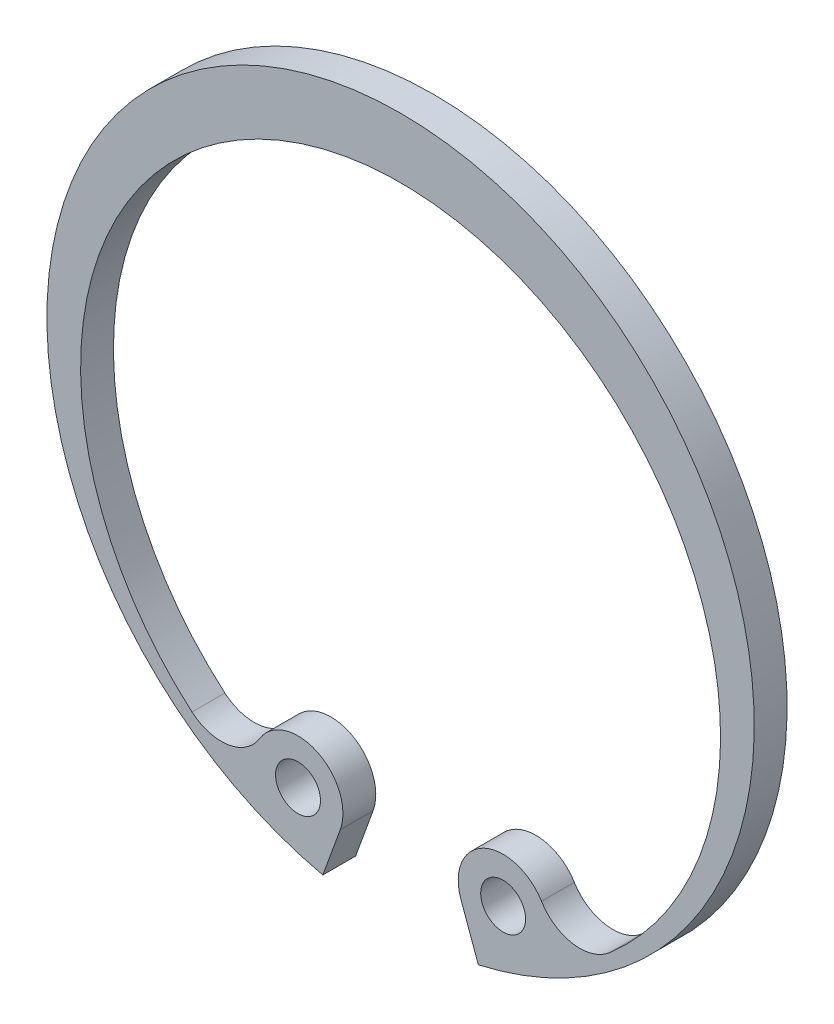
ISO-10303-21;
HEADER;
FILE_DESCRIPTION(('STEP AP214'),'2;1');
FILE_NAME('part.step','',(''),(''),'','','');
FILE_SCHEMA(('AUTOMOTIVE_DESIGN { 1 0 10303 214 1 1 1 1 }'));
ENDSEC;
DATA;
#1=APPLICATION_CONTEXT('core data for automotive mechanical design processes');
#2=APPLICATION_PROTOCOL_DEFINITION('international standard','automotive_design',2000,#1);
#3=PRODUCT_CONTEXT('',#1,'mechanical');
#4=PRODUCT('Part','Part','',(#3));
#5=PRODUCT_RELATED_PRODUCT_CATEGORY('part','',(#4));
#6=PRODUCT_DEFINITION_FORMATION('','',#4);
#7=PRODUCT_DEFINITION_CONTEXT('part definition',#1,'design');
#8=PRODUCT_DEFINITION('design','',#6,#7);
#9=PRODUCT_DEFINITION_SHAPE('','',#8);
#10=(LENGTH_UNIT() NAMED_UNIT(*) SI_UNIT(.MILLI.,.METRE.));
#11=(NAMED_UNIT(*) PLANE_ANGLE_UNIT() SI_UNIT($,.RADIAN.));
#12=(NAMED_UNIT(*) SI_UNIT($,.STERADIAN.) SOLID_ANGLE_UNIT());
#13=UNCERTAINTY_MEASURE_WITH_UNIT(LENGTH_MEASURE(1.E-05),#10,'distance_accuracy_value','');
#14=(GEOMETRIC_REPRESENTATION_CONTEXT(3) GLOBAL_UNCERTAINTY_ASSIGNED_CONTEXT((#13)) GLOBAL_UNIT_ASSIGNED_CONTEXT((#10,
#11,#12)) REPRESENTATION_CONTEXT('',''));
#15=CARTESIAN_POINT('',(0.,0.,0.));
#16=DIRECTION('',(0.,0.,1.));
#17=DIRECTION('',(1.,0.,0.));
#18=AXIS2_PLACEMENT_3D('',#15,#16,#17);
#19=CARTESIAN_POINT('',(0.,0.,0.975));
#20=DIRECTION('',(0.,0.,-1.));
#21=DIRECTION('',(-1.,0.,0.));
#22=AXIS2_PLACEMENT_3D('',#19,#20,#21);
#23=PLANE('',#22);
#24=CARTESIAN_POINT('',(-5.32360078088962,-6.98043795968956,0.975));
#25=DIRECTION('',(0.,0.,-1.));
#26=DIRECTION('',(-1.,0.,0.));
#27=AXIS2_PLACEMENT_3D('',#24,#25,#26);
#28=CIRCLE('',#27,1.33333333333333);
#29=CARTESIAN_POINT('',(-6.19276009205528,-7.99154619800622,0.975));
#30=VERTEX_POINT('',#29);
#31=CARTESIAN_POINT('',(-4.18415582842588,-7.67285617008171,0.975));
#32=VERTEX_POINT('',#31);
#33=EDGE_CURVE('E141',#30,#32,#28,.F.);
#34=ORIENTED_EDGE('',*,*,#33,.T.);
#35=CARTESIAN_POINT('',(-3.04471087596214,-8.36527438047387,0.975));
#36=DIRECTION('',(0.,0.,-1.));
#37=DIRECTION('',(-1.,0.,0.));
#38=AXIS2_PLACEMENT_3D('',#35,#36,#37);
#39=CIRCLE('',#38,1.33333333333333);
#40=CARTESIAN_POINT('',(-1.79178738158093,-8.82130123824143,0.975));
#41=VERTEX_POINT('',#40);
#42=EDGE_CURVE('E97',#41,#32,#39,.F.);
#43=ORIENTED_EDGE('',*,*,#42,.F.);
#44=DIRECTION('',(-0.34202014332567,-0.939692620785908,0.));
#45=VECTOR('',#44,1.);
#46=CARTESIAN_POINT('',(-1.79178738158093,-8.82130123824143,0.975));
#47=LINE('',#46,#45);
#48=CARTESIAN_POINT('',(-2.30921625274565,-10.2429253779404,0.975));
#49=VERTEX_POINT('',#48);
#50=EDGE_CURVE('E94',#41,#49,#47,.T.);
#51=ORIENTED_EDGE('',*,*,#50,.T.);
#52=CARTESIAN_POINT('',(0.,0.,0.975));
#53=DIRECTION('',(0.,0.,-1.));
#54=DIRECTION('',(-1.,0.,0.));
#55=AXIS2_PLACEMENT_3D('',#52,#53,#54);
#56=CIRCLE('',#55,10.5);
#57=CARTESIAN_POINT('',(2.30921625274565,-10.2429253779404,0.975));
#58=VERTEX_POINT('',#57);
#59=EDGE_CURVE('E82',#58,#49,#56,.F.);
#60=ORIENTED_EDGE('',*,*,#59,.F.);
#61=DIRECTION('',(-0.34202014332567,0.939692620785908,0.));
#62=VECTOR('',#61,1.);
#63=CARTESIAN_POINT('',(1.79178738158093,-8.82130123824143,0.975));
#64=LINE('',#63,#62);
#65=CARTESIAN_POINT('',(1.79178738158093,-8.82130123824143,0.975));
#66=VERTEX_POINT('',#65);
#67=EDGE_CURVE('E109',#58,#66,#64,.T.);
#68=ORIENTED_EDGE('',*,*,#67,.T.);
#69=CARTESIAN_POINT('',(3.04471087596214,-8.36527438047387,0.975));
#70=DIRECTION('',(0.,0.,-1.));
#71=DIRECTION('',(-1.,0.,0.));
#72=AXIS2_PLACEMENT_3D('',#69,#70,#71);
#73=CIRCLE('',#72,1.33333333333333);
#74=CARTESIAN_POINT('',(4.18415582842588,-7.67285617008171,0.975));
#75=VERTEX_POINT('',#74);
#76=EDGE_CURVE('E130',#75,#66,#73,.F.);
#77=ORIENTED_EDGE('',*,*,#76,.F.);
#78=CARTESIAN_POINT('',(5.32360078088962,-6.98043795968956,0.975));
#79=DIRECTION('',(0.,0.,-1.));
#80=DIRECTION('',(-1.,0.,0.));
#81=AXIS2_PLACEMENT_3D('',#78,#79,#80);
#82=CIRCLE('',#81,1.33333333333333);
#83=CARTESIAN_POINT('',(6.19276009205528,-7.99154619800622,0.975));
#84=VERTEX_POINT('',#83);
#85=EDGE_CURVE('E134',#75,#84,#82,.F.);
#86=ORIENTED_EDGE('',*,*,#85,.T.);
#87=CARTESIAN_POINT('',(0.,-0.7874,0.975));
#88=DIRECTION('',(0.,0.,-1.));
#89=DIRECTION('',(-1.,0.,0.));
#90=AXIS2_PLACEMENT_3D('',#87,#88,#89);
#91=CIRCLE('',#90,9.5);
#92=EDGE_CURVE('E138',#84,#30,#91,.F.);
#93=ORIENTED_EDGE('',*,*,#92,.T.);
#94=EDGE_LOOP('',(#34,#43,#51,#60,#68,#77,#86,#93));
#95=FACE_BOUND('',#94,.T.);
#96=CARTESIAN_POINT('',(3.04471087596214,-8.36527438047387,0.975));
#97=DIRECTION('',(0.,0.,-1.));
#98=DIRECTION('',(-1.,0.,0.));
#99=AXIS2_PLACEMENT_3D('',#96,#97,#98);
#100=CIRCLE('',#99,0.666666666666667);
#101=CARTESIAN_POINT('',(2.37804420929547,-8.36527438047387,0.975));
#102=VERTEX_POINT('',#101);
#103=EDGE_CURVE('E21',#102,#102,#100,.F.);
#104=ORIENTED_EDGE('',*,*,#103,.T.);
#105=EDGE_LOOP('',(#104));
#106=FACE_BOUND('',#105,.T.);
#107=CARTESIAN_POINT('',(-3.04471087596214,-8.36527438047387,0.975));
#108=DIRECTION('',(0.,0.,-1.));
#109=DIRECTION('',(-1.,0.,0.));
#110=AXIS2_PLACEMENT_3D('',#107,#108,#109);
#111=CIRCLE('',#110,0.666666666666667);
#112=CARTESIAN_POINT('',(-3.71137754262881,-8.36527438047387,0.975));
#113=VERTEX_POINT('',#112);
#114=EDGE_CURVE('E110',#113,#113,#111,.F.);
#115=ORIENTED_EDGE('',*,*,#114,.T.);
#116=EDGE_LOOP('',(#115));
#117=FACE_BOUND('',#116,.T.);
#118=ADVANCED_FACE('F18',(#95,#106,#117),#23,.T.);
#119=CARTESIAN_POINT('',(3.04471087596214,-8.36527438047387,1.95));
#120=DIRECTION('',(0.,0.,-1.));
#121=DIRECTION('',(-1.,0.,0.));
#122=AXIS2_PLACEMENT_3D('',#119,#120,#121);
#123=CYLINDRICAL_SURFACE('',#122,0.666666666666667);
#124=CARTESIAN_POINT('',(3.04471087596214,-8.36527438047387,1.95));
#125=DIRECTION('',(0.,0.,-1.));
#126=DIRECTION('',(-1.,0.,0.));
#127=AXIS2_PLACEMENT_3D('',#124,#125,#126);
#128=CIRCLE('',#127,0.666666666666667);
#129=CARTESIAN_POINT('',(2.37804420929547,-8.36527438047387,1.95));
#130=VERTEX_POINT('',#129);
#131=EDGE_CURVE('E125',#130,#130,#128,.T.);
#132=ORIENTED_EDGE('',*,*,#131,.F.);
#133=EDGE_LOOP('',(#132));
#134=FACE_BOUND('',#133,.T.);
#135=ORIENTED_EDGE('',*,*,#103,.F.);
#136=EDGE_LOOP('',(#135));
#137=FACE_BOUND('',#136,.T.);
#138=ADVANCED_FACE('F245',(#134,#137),#123,.F.);
#139=CARTESIAN_POINT('',(0.,0.,0.975));
#140=DIRECTION('',(0.,0.,-1.));
#141=DIRECTION('',(-1.,0.,0.));
#142=AXIS2_PLACEMENT_3D('',#139,#140,#141);
#143=CYLINDRICAL_SURFACE('',#142,10.5);
#144=ORIENTED_EDGE('',*,*,#59,.T.);
#145=DIRECTION('',(0.,0.,1.));
#146=VECTOR('',#145,1.);
#147=CARTESIAN_POINT('',(-2.30921625274565,-10.2429253779404,1.95));
#148=LINE('',#147,#146);
#149=CARTESIAN_POINT('',(-2.30921625274565,-10.2429253779404,1.95));
#150=VERTEX_POINT('',#149);
#151=EDGE_CURVE('E86',#49,#150,#148,.T.);
#152=ORIENTED_EDGE('',*,*,#151,.T.);
#153=CARTESIAN_POINT('',(0.,0.,1.95));
#154=DIRECTION('',(0.,0.,-1.));
#155=DIRECTION('',(-1.,0.,0.));
#156=AXIS2_PLACEMENT_3D('',#153,#154,#155);
#157=CIRCLE('',#156,10.5);
#158=CARTESIAN_POINT('',(2.30921625274565,-10.2429253779404,1.95));
#159=VERTEX_POINT('',#158);
#160=EDGE_CURVE('E123',#159,#150,#157,.F.);
#161=ORIENTED_EDGE('',*,*,#160,.F.);
#162=DIRECTION('',(0.,0.,1.));
#163=VECTOR('',#162,1.);
#164=CARTESIAN_POINT('',(2.30921625274565,-10.2429253779404,1.95));
#165=LINE('',#164,#163);
#166=EDGE_CURVE('E89',#159,#58,#165,.F.);
#167=ORIENTED_EDGE('',*,*,#166,.T.);
#168=EDGE_LOOP('',(#144,#152,#161,#167));
#169=FACE_BOUND('',#168,.T.);
#170=ADVANCED_FACE('F84',(#169),#143,.T.);
#171=CARTESIAN_POINT('',(-1.79178738158093,-8.82130123824143,1.95));
#172=DIRECTION('',(-0.939692620785908,0.34202014332567,0.));
#173=DIRECTION('',(-0.34202014332567,-0.939692620785908,0.));
#174=AXIS2_PLACEMENT_3D('',#171,#172,#173);
#175=PLANE('',#174);
#176=DIRECTION('',(0.,0.,-1.));
#177=VECTOR('',#176,1.);
#178=CARTESIAN_POINT('',(-1.79178738158093,-8.82130123824143,1.95));
#179=LINE('',#178,#177);
#180=CARTESIAN_POINT('',(-1.79178738158093,-8.82130123824143,1.95));
#181=VERTEX_POINT('',#180);
#182=EDGE_CURVE('E107',#181,#41,#179,.T.);
#183=ORIENTED_EDGE('',*,*,#182,.F.);
#184=DIRECTION('',(0.34202014332567,0.939692620785908,0.));
#185=VECTOR('',#184,1.);
#186=CARTESIAN_POINT('',(-2.30921625274565,-10.2429253779404,1.95));
#187=LINE('',#186,#185);
#188=EDGE_CURVE('E103',#150,#181,#187,.T.);
#189=ORIENTED_EDGE('',*,*,#188,.F.);
#190=ORIENTED_EDGE('',*,*,#151,.F.);
#191=ORIENTED_EDGE('',*,*,#50,.F.);
#192=EDGE_LOOP('',(#183,#189,#190,#191));
#193=FACE_BOUND('',#192,.T.);
#194=ADVANCED_FACE('F101',(#193),#175,.F.);
#195=CARTESIAN_POINT('',(-3.04471087596214,-8.36527438047387,1.95));
#196=DIRECTION('',(0.,0.,-1.));
#197=DIRECTION('',(-1.,0.,0.));
#198=AXIS2_PLACEMENT_3D('',#195,#196,#197);
#199=CYLINDRICAL_SURFACE('',#198,1.33333333333333);
#200=CARTESIAN_POINT('',(-3.04471087596214,-8.36527438047387,1.95));
#201=DIRECTION('',(0.,0.,-1.));
#202=DIRECTION('',(-1.,0.,0.));
#203=AXIS2_PLACEMENT_3D('',#200,#201,#202);
#204=CIRCLE('',#203,1.33333333333333);
#205=CARTESIAN_POINT('',(-4.18415582842588,-7.67285617008171,1.95));
#206=VERTEX_POINT('',#205);
#207=EDGE_CURVE('E120',#181,#206,#204,.F.);
#208=ORIENTED_EDGE('',*,*,#207,.F.);
#209=ORIENTED_EDGE('',*,*,#182,.T.);
#210=ORIENTED_EDGE('',*,*,#42,.T.);
#211=DIRECTION('',(0.,0.,-1.));
#212=VECTOR('',#211,1.);
#213=CARTESIAN_POINT('',(-4.18415582842588,-7.67285617008171,1.95));
#214=LINE('',#213,#212);
#215=EDGE_CURVE('E143',#32,#206,#214,.F.);
#216=ORIENTED_EDGE('',*,*,#215,.T.);
#217=EDGE_LOOP('',(#208,#209,#210,#216));
#218=FACE_BOUND('',#217,.T.);
#219=ADVANCED_FACE('F177',(#218),#199,.T.);
#220=CARTESIAN_POINT('',(-5.32360078088962,-6.98043795968956,1.95));
#221=DIRECTION('',(0.,0.,-1.));
#222=DIRECTION('',(-1.,0.,0.));
#223=AXIS2_PLACEMENT_3D('',#220,#221,#222);
#224=CYLINDRICAL_SURFACE('',#223,1.33333333333333);
#225=DIRECTION('',(0.,0.,-1.));
#226=VECTOR('',#225,1.);
#227=CARTESIAN_POINT('',(-6.19276009205527,-7.99154619800622,1.95));
#228=LINE('',#227,#226);
#229=CARTESIAN_POINT('',(-6.19276009205528,-7.99154619800622,1.95));
#230=VERTEX_POINT('',#229);
#231=EDGE_CURVE('E140',#30,#230,#228,.F.);
#232=ORIENTED_EDGE('',*,*,#231,.T.);
#233=CARTESIAN_POINT('',(-5.32360078088962,-6.98043795968956,1.95));
#234=DIRECTION('',(0.,0.,-1.));
#235=DIRECTION('',(-1.,0.,0.));
#236=AXIS2_PLACEMENT_3D('',#233,#234,#235);
#237=CIRCLE('',#236,1.33333333333333);
#238=EDGE_CURVE('E117',#206,#230,#237,.T.);
#239=ORIENTED_EDGE('',*,*,#238,.F.);
#240=ORIENTED_EDGE('',*,*,#215,.F.);
#241=ORIENTED_EDGE('',*,*,#33,.F.);
#242=EDGE_LOOP('',(#232,#239,#240,#241));
#243=FACE_BOUND('',#242,.T.);
#244=ADVANCED_FACE('F176',(#243),#224,.F.);
#245=CARTESIAN_POINT('',(0.,-0.7874,1.95));
#246=DIRECTION('',(0.,0.,-1.));
#247=DIRECTION('',(-1.,0.,0.));
#248=AXIS2_PLACEMENT_3D('',#245,#246,#247);
#249=CYLINDRICAL_SURFACE('',#248,9.5);
#250=DIRECTION('',(0.,0.,-1.));
#251=VECTOR('',#250,1.);
#252=CARTESIAN_POINT('',(6.19276009205528,-7.99154619800622,1.95));
#253=LINE('',#252,#251);
#254=CARTESIAN_POINT('',(6.19276009205528,-7.99154619800622,1.95));
#255=VERTEX_POINT('',#254);
#256=EDGE_CURVE('E137',#84,#255,#253,.F.);
#257=ORIENTED_EDGE('',*,*,#256,.T.);
#258=CARTESIAN_POINT('',(0.,-0.7874,1.95));
#259=DIRECTION('',(0.,0.,-1.));
#260=DIRECTION('',(-1.,0.,0.));
#261=AXIS2_PLACEMENT_3D('',#258,#259,#260);
#262=CIRCLE('',#261,9.5);
#263=EDGE_CURVE('E115',#230,#255,#262,.T.);
#264=ORIENTED_EDGE('',*,*,#263,.F.);
#265=ORIENTED_EDGE('',*,*,#231,.F.);
#266=ORIENTED_EDGE('',*,*,#92,.F.);
#267=EDGE_LOOP('',(#257,#264,#265,#266));
#268=FACE_BOUND('',#267,.T.);
#269=ADVANCED_FACE('F173',(#268),#249,.F.);
#270=CARTESIAN_POINT('',(5.32360078088962,-6.98043795968956,1.95));
#271=DIRECTION('',(0.,0.,-1.));
#272=DIRECTION('',(-1.,0.,0.));
#273=AXIS2_PLACEMENT_3D('',#270,#271,#272);
#274=CYLINDRICAL_SURFACE('',#273,1.33333333333333);
#275=DIRECTION('',(0.,0.,-1.));
#276=VECTOR('',#275,1.);
#277=CARTESIAN_POINT('',(4.18415582842588,-7.67285617008171,1.95));
#278=LINE('',#277,#276);
#279=CARTESIAN_POINT('',(4.18415582842588,-7.67285617008171,1.95));
#280=VERTEX_POINT('',#279);
#281=EDGE_CURVE('E133',#280,#75,#278,.T.);
#282=ORIENTED_EDGE('',*,*,#281,.F.);
#283=CARTESIAN_POINT('',(5.32360078088962,-6.98043795968956,1.95));
#284=DIRECTION('',(0.,0.,-1.));
#285=DIRECTION('',(-1.,0.,0.));
#286=AXIS2_PLACEMENT_3D('',#283,#284,#285);
#287=CIRCLE('',#286,1.33333333333333);
#288=EDGE_CURVE('E113',#255,#280,#287,.T.);
#289=ORIENTED_EDGE('',*,*,#288,.F.);
#290=ORIENTED_EDGE('',*,*,#256,.F.);
#291=ORIENTED_EDGE('',*,*,#85,.F.);
#292=EDGE_LOOP('',(#282,#289,#290,#291));
#293=FACE_BOUND('',#292,.T.);
#294=ADVANCED_FACE('F167',(#293),#274,.F.);
#295=CARTESIAN_POINT('',(3.04471087596214,-8.36527438047387,1.95));
#296=DIRECTION('',(0.,0.,-1.));
#297=DIRECTION('',(-1.,0.,0.));
#298=AXIS2_PLACEMENT_3D('',#295,#296,#297);
#299=CYLINDRICAL_SURFACE('',#298,1.33333333333333);
#300=ORIENTED_EDGE('',*,*,#76,.T.);
#301=DIRECTION('',(0.,0.,1.));
#302=VECTOR('',#301,1.);
#303=CARTESIAN_POINT('',(1.79178738158093,-8.82130123824143,1.95));
#304=LINE('',#303,#302);
#305=CARTESIAN_POINT('',(1.79178738158093,-8.82130123824143,1.95));
#306=VERTEX_POINT('',#305);
#307=EDGE_CURVE('E132',#66,#306,#304,.T.);
#308=ORIENTED_EDGE('',*,*,#307,.T.);
#309=CARTESIAN_POINT('',(3.04471087596214,-8.36527438047387,1.95));
#310=DIRECTION('',(0.,0.,-1.));
#311=DIRECTION('',(-1.,0.,0.));
#312=AXIS2_PLACEMENT_3D('',#309,#310,#311);
#313=CIRCLE('',#312,1.33333333333333);
#314=EDGE_CURVE('E36',#280,#306,#313,.F.);
#315=ORIENTED_EDGE('',*,*,#314,.F.);
#316=ORIENTED_EDGE('',*,*,#281,.T.);
#317=EDGE_LOOP('',(#300,#308,#315,#316));
#318=FACE_BOUND('',#317,.T.);
#319=ADVANCED_FACE('F169',(#318),#299,.T.);
#320=CARTESIAN_POINT('',(1.79178738158093,-8.82130123824143,1.95));
#321=DIRECTION('',(0.939692620785908,0.34202014332567,0.));
#322=DIRECTION('',(-0.34202014332567,0.939692620785908,0.));
#323=AXIS2_PLACEMENT_3D('',#320,#321,#322);
#324=PLANE('',#323);
#325=ORIENTED_EDGE('',*,*,#166,.F.);
#326=DIRECTION('',(0.34202014332567,-0.939692620785908,0.));
#327=VECTOR('',#326,1.);
#328=CARTESIAN_POINT('',(1.79178738158093,-8.82130123824143,1.95));
#329=LINE('',#328,#327);
#330=EDGE_CURVE('E27',#306,#159,#329,.T.);
#331=ORIENTED_EDGE('',*,*,#330,.F.);
#332=ORIENTED_EDGE('',*,*,#307,.F.);
#333=ORIENTED_EDGE('',*,*,#67,.F.);
#334=EDGE_LOOP('',(#325,#331,#332,#333));
#335=FACE_BOUND('',#334,.T.);
#336=ADVANCED_FACE('F162',(#335),#324,.F.);
#337=CARTESIAN_POINT('',(-3.04471087596214,-8.36527438047387,1.95));
#338=DIRECTION('',(0.,0.,-1.));
#339=DIRECTION('',(-1.,0.,0.));
#340=AXIS2_PLACEMENT_3D('',#337,#338,#339);
#341=CYLINDRICAL_SURFACE('',#340,0.666666666666667);
#342=CARTESIAN_POINT('',(-3.04471087596214,-8.36527438047387,1.95));
#343=DIRECTION('',(0.,0.,-1.));
#344=DIRECTION('',(-1.,0.,0.));
#345=AXIS2_PLACEMENT_3D('',#342,#343,#344);
#346=CIRCLE('',#345,0.666666666666667);
#347=CARTESIAN_POINT('',(-3.71137754262881,-8.36527438047387,1.95));
#348=VERTEX_POINT('',#347);
#349=EDGE_CURVE('E11',#348,#348,#346,.T.);
#350=ORIENTED_EDGE('',*,*,#349,.F.);
#351=EDGE_LOOP('',(#350));
#352=FACE_BOUND('',#351,.T.);
#353=ORIENTED_EDGE('',*,*,#114,.F.);
#354=EDGE_LOOP('',(#353));
#355=FACE_BOUND('',#354,.T.);
#356=ADVANCED_FACE('F188',(#352,#355),#341,.F.);
#357=CARTESIAN_POINT('',(0.,0.,1.95));
#358=DIRECTION('',(0.,0.,1.));
#359=DIRECTION('',(1.,0.,0.));
#360=AXIS2_PLACEMENT_3D('',#357,#358,#359);
#361=PLANE('',#360);
#362=ORIENTED_EDGE('',*,*,#349,.T.);
#363=EDGE_LOOP('',(#362));
#364=FACE_BOUND('',#363,.T.);
#365=ORIENTED_EDGE('',*,*,#314,.T.);
#366=ORIENTED_EDGE('',*,*,#330,.T.);
#367=ORIENTED_EDGE('',*,*,#160,.T.);
#368=ORIENTED_EDGE('',*,*,#188,.T.);
#369=ORIENTED_EDGE('',*,*,#207,.T.);
#370=ORIENTED_EDGE('',*,*,#238,.T.);
#371=ORIENTED_EDGE('',*,*,#263,.T.);
#372=ORIENTED_EDGE('',*,*,#288,.T.);
#373=EDGE_LOOP('',(#365,#366,#367,#368,#369,#370,#371,#372));
#374=FACE_BOUND('',#373,.T.);
#375=ORIENTED_EDGE('',*,*,#131,.T.);
#376=EDGE_LOOP('',(#375));
#377=FACE_BOUND('',#376,.T.);
#378=ADVANCED_FACE('F158',(#364,#374,#377),#361,.T.);
#379=CLOSED_SHELL('',(#118,#138,#170,#194,#219,#244,#269,#294,#319,#336,#356,#378));
#380=MANIFOLD_SOLID_BREP('B1',#379);
#381=ADVANCED_BREP_SHAPE_REPRESENTATION('',(#18,#380),#14);
#382=SHAPE_DEFINITION_REPRESENTATION(#9,#381);
ENDSEC;
END-ISO-10303-21;
